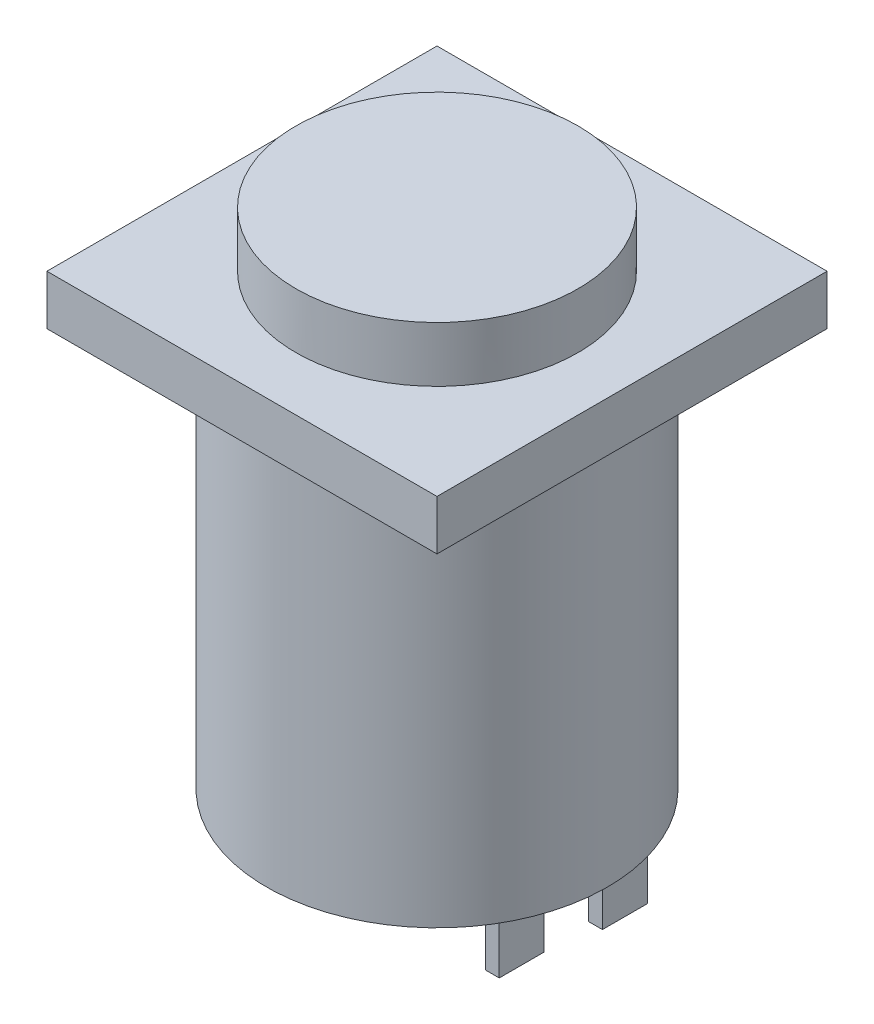
ISO-10303-21;
HEADER;
FILE_DESCRIPTION(('STEP AP214'),'2;1');
FILE_NAME('part.step','',(''),(''),'','','');
FILE_SCHEMA(('AUTOMOTIVE_DESIGN { 1 0 10303 214 1 1 1 1 }'));
ENDSEC;
DATA;
#1=APPLICATION_CONTEXT('core data for automotive mechanical design processes');
#2=APPLICATION_PROTOCOL_DEFINITION('international standard','automotive_design',2000,#1);
#3=PRODUCT_CONTEXT('',#1,'mechanical');
#4=PRODUCT('Part','Part','',(#3));
#5=PRODUCT_RELATED_PRODUCT_CATEGORY('part','',(#4));
#6=PRODUCT_DEFINITION_FORMATION('','',#4);
#7=PRODUCT_DEFINITION_CONTEXT('part definition',#1,'design');
#8=PRODUCT_DEFINITION('design','',#6,#7);
#9=PRODUCT_DEFINITION_SHAPE('','',#8);
#10=(LENGTH_UNIT() NAMED_UNIT(*) SI_UNIT(.MILLI.,.METRE.));
#11=(NAMED_UNIT(*) PLANE_ANGLE_UNIT() SI_UNIT($,.RADIAN.));
#12=(NAMED_UNIT(*) SI_UNIT($,.STERADIAN.) SOLID_ANGLE_UNIT());
#13=UNCERTAINTY_MEASURE_WITH_UNIT(LENGTH_MEASURE(1.E-05),#10,'distance_accuracy_value','');
#14=(GEOMETRIC_REPRESENTATION_CONTEXT(3) GLOBAL_UNCERTAINTY_ASSIGNED_CONTEXT((#13)) GLOBAL_UNIT_ASSIGNED_CONTEXT((#10,
#11,#12)) REPRESENTATION_CONTEXT('',''));
#15=CARTESIAN_POINT('',(0.,0.,0.));
#16=DIRECTION('',(0.,0.,1.));
#17=DIRECTION('',(1.,0.,0.));
#18=AXIS2_PLACEMENT_3D('',#15,#16,#17);
#19=CARTESIAN_POINT('',(0.,-18.288,0.));
#20=DIRECTION('',(0.,-1.,0.));
#21=DIRECTION('',(0.,0.,-1.));
#22=AXIS2_PLACEMENT_3D('',#19,#20,#21);
#23=PLANE('',#22);
#24=DIRECTION('',(1.,0.,0.));
#25=VECTOR('',#24,1.);
#26=CARTESIAN_POINT('',(-3.302,-18.288,-6.35));
#27=LINE('',#26,#25);
#28=CARTESIAN_POINT('',(-3.302,-18.288,-6.35));
#29=VERTEX_POINT('',#28);
#30=CARTESIAN_POINT('',(-2.667,-18.288,-6.35));
#31=VERTEX_POINT('',#30);
#32=EDGE_CURVE('E243',#29,#31,#27,.T.);
#33=ORIENTED_EDGE('',*,*,#32,.F.);
#34=DIRECTION('',(0.,0.,-1.));
#35=VECTOR('',#34,1.);
#36=CARTESIAN_POINT('',(-3.302,-18.288,-4.2926));
#37=LINE('',#36,#35);
#38=CARTESIAN_POINT('',(-3.302,-18.288,-4.2926));
#39=VERTEX_POINT('',#38);
#40=EDGE_CURVE('E238',#39,#29,#37,.T.);
#41=ORIENTED_EDGE('',*,*,#40,.F.);
#42=DIRECTION('',(-1.,0.,0.));
#43=VECTOR('',#42,1.);
#44=CARTESIAN_POINT('',(-3.302,-18.288,-4.2926));
#45=LINE('',#44,#43);
#46=CARTESIAN_POINT('',(-2.667,-18.288,-4.2926));
#47=VERTEX_POINT('',#46);
#48=EDGE_CURVE('E254',#47,#39,#45,.T.);
#49=ORIENTED_EDGE('',*,*,#48,.F.);
#50=DIRECTION('',(0.,0.,1.));
#51=VECTOR('',#50,1.);
#52=CARTESIAN_POINT('',(-2.667,-18.288,-4.2926));
#53=LINE('',#52,#51);
#54=EDGE_CURVE('E266',#31,#47,#53,.T.);
#55=ORIENTED_EDGE('',*,*,#54,.F.);
#56=EDGE_LOOP('',(#33,#41,#49,#55));
#57=FACE_BOUND('',#56,.T.);
#58=DIRECTION('',(1.,0.,0.));
#59=VECTOR('',#58,1.);
#60=CARTESIAN_POINT('',(-2.8575,-18.288,-2.0574));
#61=LINE('',#60,#59);
#62=CARTESIAN_POINT('',(-2.8575,-18.288,-2.0574));
#63=VERTEX_POINT('',#62);
#64=CARTESIAN_POINT('',(-2.2225,-18.288,-2.0574));
#65=VERTEX_POINT('',#64);
#66=EDGE_CURVE('E342',#63,#65,#61,.T.);
#67=ORIENTED_EDGE('',*,*,#66,.F.);
#68=DIRECTION('',(0.,0.,-1.));
#69=VECTOR('',#68,1.);
#70=CARTESIAN_POINT('',(-2.8575,-18.288,0.));
#71=LINE('',#70,#69);
#72=CARTESIAN_POINT('',(-2.8575,-18.288,0.));
#73=VERTEX_POINT('',#72);
#74=EDGE_CURVE('E323',#73,#63,#71,.T.);
#75=ORIENTED_EDGE('',*,*,#74,.F.);
#76=DIRECTION('',(-1.,0.,0.));
#77=VECTOR('',#76,1.);
#78=CARTESIAN_POINT('',(-2.8575,-18.288,0.));
#79=LINE('',#78,#77);
#80=CARTESIAN_POINT('',(-2.2225,-18.288,0.));
#81=VERTEX_POINT('',#80);
#82=EDGE_CURVE('E329',#81,#73,#79,.T.);
#83=ORIENTED_EDGE('',*,*,#82,.F.);
#84=DIRECTION('',(0.,0.,1.));
#85=VECTOR('',#84,1.);
#86=CARTESIAN_POINT('',(-2.2225,-18.288,0.));
#87=LINE('',#86,#85);
#88=EDGE_CURVE('E345',#65,#81,#87,.T.);
#89=ORIENTED_EDGE('',*,*,#88,.F.);
#90=EDGE_LOOP('',(#67,#75,#83,#89));
#91=FACE_BOUND('',#90,.T.);
#92=CARTESIAN_POINT('',(0.,-18.288,0.));
#93=DIRECTION('',(0.,-1.,0.));
#94=DIRECTION('',(0.,0.,-1.));
#95=AXIS2_PLACEMENT_3D('',#92,#93,#94);
#96=CIRCLE('',#95,7.8232);
#97=CARTESIAN_POINT('',(0.,-18.288,-7.8232));
#98=VERTEX_POINT('',#97);
#99=EDGE_CURVE('E365',#98,#98,#96,.T.);
#100=ORIENTED_EDGE('',*,*,#99,.T.);
#101=EDGE_LOOP('',(#100));
#102=FACE_BOUND('',#101,.T.);
#103=DIRECTION('',(1.,0.,0.));
#104=VECTOR('',#103,1.);
#105=CARTESIAN_POINT('',(2.2225,-18.288,-2.0574));
#106=LINE('',#105,#104);
#107=CARTESIAN_POINT('',(2.2225,-18.288,-2.0574));
#108=VERTEX_POINT('',#107);
#109=CARTESIAN_POINT('',(2.8575,-18.288,-2.0574));
#110=VERTEX_POINT('',#109);
#111=EDGE_CURVE('E302',#108,#110,#106,.T.);
#112=ORIENTED_EDGE('',*,*,#111,.F.);
#113=DIRECTION('',(0.,0.,-1.));
#114=VECTOR('',#113,1.);
#115=CARTESIAN_POINT('',(2.2225,-18.288,0.));
#116=LINE('',#115,#114);
#117=CARTESIAN_POINT('',(2.2225,-18.288,0.));
#118=VERTEX_POINT('',#117);
#119=EDGE_CURVE('E283',#118,#108,#116,.T.);
#120=ORIENTED_EDGE('',*,*,#119,.F.);
#121=DIRECTION('',(-1.,0.,0.));
#122=VECTOR('',#121,1.);
#123=CARTESIAN_POINT('',(2.2225,-18.288,0.));
#124=LINE('',#123,#122);
#125=CARTESIAN_POINT('',(2.8575,-18.288,0.));
#126=VERTEX_POINT('',#125);
#127=EDGE_CURVE('E289',#126,#118,#124,.T.);
#128=ORIENTED_EDGE('',*,*,#127,.F.);
#129=DIRECTION('',(0.,0.,1.));
#130=VECTOR('',#129,1.);
#131=CARTESIAN_POINT('',(2.8575,-18.288,0.));
#132=LINE('',#131,#130);
#133=EDGE_CURVE('E305',#110,#126,#132,.T.);
#134=ORIENTED_EDGE('',*,*,#133,.F.);
#135=EDGE_LOOP('',(#112,#120,#128,#134));
#136=FACE_BOUND('',#135,.T.);
#137=DIRECTION('',(-1.,0.,0.));
#138=VECTOR('',#137,1.);
#139=CARTESIAN_POINT('',(3.302,-18.288,-4.2926));
#140=LINE('',#139,#138);
#141=CARTESIAN_POINT('',(3.302,-18.288,-4.2926));
#142=VERTEX_POINT('',#141);
#143=CARTESIAN_POINT('',(2.667,-18.288,-4.2926));
#144=VERTEX_POINT('',#143);
#145=EDGE_CURVE('E478',#142,#144,#140,.T.);
#146=ORIENTED_EDGE('',*,*,#145,.F.);
#147=DIRECTION('',(0.,0.,1.));
#148=VECTOR('',#147,1.);
#149=CARTESIAN_POINT('',(3.302,-18.288,-4.2926));
#150=LINE('',#149,#148);
#151=CARTESIAN_POINT('',(3.302,-18.288,-6.35));
#152=VERTEX_POINT('',#151);
#153=EDGE_CURVE('E235',#152,#142,#150,.T.);
#154=ORIENTED_EDGE('',*,*,#153,.F.);
#155=DIRECTION('',(1.,0.,0.));
#156=VECTOR('',#155,1.);
#157=CARTESIAN_POINT('',(3.302,-18.288,-6.35));
#158=LINE('',#157,#156);
#159=CARTESIAN_POINT('',(2.667,-18.288,-6.35));
#160=VERTEX_POINT('',#159);
#161=EDGE_CURVE('E231',#160,#152,#158,.T.);
#162=ORIENTED_EDGE('',*,*,#161,.F.);
#163=DIRECTION('',(0.,0.,-1.));
#164=VECTOR('',#163,1.);
#165=CARTESIAN_POINT('',(2.667,-18.288,-4.2926));
#166=LINE('',#165,#164);
#167=EDGE_CURVE('E480',#144,#160,#166,.T.);
#168=ORIENTED_EDGE('',*,*,#167,.F.);
#169=EDGE_LOOP('',(#146,#154,#162,#168));
#170=FACE_BOUND('',#169,.T.);
#171=ADVANCED_FACE('F38',(#57,#91,#102,#136,#170),#23,.T.);
#172=CARTESIAN_POINT('',(0.,0.,0.));
#173=DIRECTION('',(0.,-1.,0.));
#174=DIRECTION('',(0.,0.,-1.));
#175=AXIS2_PLACEMENT_3D('',#172,#173,#174);
#176=PLANE('',#175);
#177=DIRECTION('',(0.,0.,-1.));
#178=VECTOR('',#177,1.);
#179=CARTESIAN_POINT('',(8.9535,0.,-8.9535));
#180=LINE('',#179,#178);
#181=CARTESIAN_POINT('',(8.9535,0.,8.9535));
#182=VERTEX_POINT('',#181);
#183=CARTESIAN_POINT('',(8.9535,0.,-8.9535));
#184=VERTEX_POINT('',#183);
#185=EDGE_CURVE('E375',#182,#184,#180,.T.);
#186=ORIENTED_EDGE('',*,*,#185,.F.);
#187=DIRECTION('',(1.,0.,0.));
#188=VECTOR('',#187,1.);
#189=CARTESIAN_POINT('',(8.9535,0.,8.9535));
#190=LINE('',#189,#188);
#191=CARTESIAN_POINT('',(-8.9535,0.,8.9535));
#192=VERTEX_POINT('',#191);
#193=EDGE_CURVE('E381',#192,#182,#190,.T.);
#194=ORIENTED_EDGE('',*,*,#193,.F.);
#195=DIRECTION('',(0.,0.,1.));
#196=VECTOR('',#195,1.);
#197=CARTESIAN_POINT('',(-8.9535,0.,-8.9535));
#198=LINE('',#197,#196);
#199=CARTESIAN_POINT('',(-8.9535,0.,-8.9535));
#200=VERTEX_POINT('',#199);
#201=EDGE_CURVE('E395',#200,#192,#198,.T.);
#202=ORIENTED_EDGE('',*,*,#201,.F.);
#203=DIRECTION('',(-1.,0.,0.));
#204=VECTOR('',#203,1.);
#205=CARTESIAN_POINT('',(8.9535,0.,-8.9535));
#206=LINE('',#205,#204);
#207=EDGE_CURVE('E392',#184,#200,#206,.T.);
#208=ORIENTED_EDGE('',*,*,#207,.F.);
#209=EDGE_LOOP('',(#186,#194,#202,#208));
#210=FACE_BOUND('',#209,.T.);
#211=CARTESIAN_POINT('',(0.,0.,0.));
#212=DIRECTION('',(0.,-1.,0.));
#213=DIRECTION('',(0.,0.,-1.));
#214=AXIS2_PLACEMENT_3D('',#211,#212,#213);
#215=CIRCLE('',#214,7.8232);
#216=CARTESIAN_POINT('',(0.,0.,-7.8232));
#217=VERTEX_POINT('',#216);
#218=EDGE_CURVE('E364',#217,#217,#215,.T.);
#219=ORIENTED_EDGE('',*,*,#218,.F.);
#220=EDGE_LOOP('',(#219));
#221=FACE_BOUND('',#220,.T.);
#222=ADVANCED_FACE('F417',(#210,#221),#176,.T.);
#223=CARTESIAN_POINT('',(0.,2.286,0.));
#224=DIRECTION('',(0.,-1.,0.));
#225=DIRECTION('',(0.,0.,-1.));
#226=AXIS2_PLACEMENT_3D('',#223,#224,#225);
#227=PLANE('',#226);
#228=DIRECTION('',(0.,0.,-1.));
#229=VECTOR('',#228,1.);
#230=CARTESIAN_POINT('',(8.9535,2.286,-8.9535));
#231=LINE('',#230,#229);
#232=CARTESIAN_POINT('',(8.9535,2.286,8.9535));
#233=VERTEX_POINT('',#232);
#234=CARTESIAN_POINT('',(8.9535,2.286,-8.9535));
#235=VERTEX_POINT('',#234);
#236=EDGE_CURVE('E376',#233,#235,#231,.T.);
#237=ORIENTED_EDGE('',*,*,#236,.T.);
#238=DIRECTION('',(-1.,0.,0.));
#239=VECTOR('',#238,1.);
#240=CARTESIAN_POINT('',(8.9535,2.286,-8.9535));
#241=LINE('',#240,#239);
#242=CARTESIAN_POINT('',(-8.9535,2.286,-8.9535));
#243=VERTEX_POINT('',#242);
#244=EDGE_CURVE('E380',#235,#243,#241,.T.);
#245=ORIENTED_EDGE('',*,*,#244,.T.);
#246=DIRECTION('',(0.,0.,1.));
#247=VECTOR('',#246,1.);
#248=CARTESIAN_POINT('',(-8.9535,2.286,-8.9535));
#249=LINE('',#248,#247);
#250=CARTESIAN_POINT('',(-8.9535,2.286,8.9535));
#251=VERTEX_POINT('',#250);
#252=EDGE_CURVE('E384',#243,#251,#249,.T.);
#253=ORIENTED_EDGE('',*,*,#252,.T.);
#254=DIRECTION('',(1.,0.,0.));
#255=VECTOR('',#254,1.);
#256=CARTESIAN_POINT('',(8.9535,2.286,8.9535));
#257=LINE('',#256,#255);
#258=EDGE_CURVE('E386',#251,#233,#257,.T.);
#259=ORIENTED_EDGE('',*,*,#258,.T.);
#260=EDGE_LOOP('',(#237,#245,#253,#259));
#261=FACE_BOUND('',#260,.T.);
#262=CARTESIAN_POINT('',(0.,2.286,0.));
#263=DIRECTION('',(0.,-1.,0.));
#264=DIRECTION('',(0.,0.,-1.));
#265=AXIS2_PLACEMENT_3D('',#262,#263,#264);
#266=CIRCLE('',#265,6.477);
#267=CARTESIAN_POINT('',(0.,2.286,-6.477));
#268=VERTEX_POINT('',#267);
#269=EDGE_CURVE('E11',#268,#268,#266,.F.);
#270=ORIENTED_EDGE('',*,*,#269,.F.);
#271=EDGE_LOOP('',(#270));
#272=FACE_BOUND('',#271,.T.);
#273=ADVANCED_FACE('F428',(#261,#272),#227,.F.);
#274=CARTESIAN_POINT('',(8.9535,2.286,-8.9535));
#275=DIRECTION('',(-1.,0.,0.));
#276=DIRECTION('',(0.,0.,1.));
#277=AXIS2_PLACEMENT_3D('',#274,#275,#276);
#278=PLANE('',#277);
#279=ORIENTED_EDGE('',*,*,#185,.T.);
#280=DIRECTION('',(0.,-1.,0.));
#281=VECTOR('',#280,1.);
#282=CARTESIAN_POINT('',(8.9535,2.286,-8.9535));
#283=LINE('',#282,#281);
#284=EDGE_CURVE('E46',#235,#184,#283,.T.);
#285=ORIENTED_EDGE('',*,*,#284,.F.);
#286=ORIENTED_EDGE('',*,*,#236,.F.);
#287=DIRECTION('',(0.,-1.,0.));
#288=VECTOR('',#287,1.);
#289=CARTESIAN_POINT('',(8.9535,2.286,8.9535));
#290=LINE('',#289,#288);
#291=EDGE_CURVE('E388',#233,#182,#290,.T.);
#292=ORIENTED_EDGE('',*,*,#291,.T.);
#293=EDGE_LOOP('',(#279,#285,#286,#292));
#294=FACE_BOUND('',#293,.T.);
#295=ADVANCED_FACE('F40',(#294),#278,.F.);
#296=CARTESIAN_POINT('',(8.9535,2.286,-8.9535));
#297=DIRECTION('',(0.,0.,1.));
#298=DIRECTION('',(1.,0.,0.));
#299=AXIS2_PLACEMENT_3D('',#296,#297,#298);
#300=PLANE('',#299);
#301=ORIENTED_EDGE('',*,*,#207,.T.);
#302=DIRECTION('',(0.,-1.,0.));
#303=VECTOR('',#302,1.);
#304=CARTESIAN_POINT('',(-8.9535,2.286,-8.9535));
#305=LINE('',#304,#303);
#306=EDGE_CURVE('E403',#243,#200,#305,.T.);
#307=ORIENTED_EDGE('',*,*,#306,.F.);
#308=ORIENTED_EDGE('',*,*,#244,.F.);
#309=ORIENTED_EDGE('',*,*,#284,.T.);
#310=EDGE_LOOP('',(#301,#307,#308,#309));
#311=FACE_BOUND('',#310,.T.);
#312=ADVANCED_FACE('F409',(#311),#300,.F.);
#313=CARTESIAN_POINT('',(-8.9535,2.286,-8.9535));
#314=DIRECTION('',(1.,0.,0.));
#315=DIRECTION('',(0.,0.,-1.));
#316=AXIS2_PLACEMENT_3D('',#313,#314,#315);
#317=PLANE('',#316);
#318=ORIENTED_EDGE('',*,*,#201,.T.);
#319=DIRECTION('',(0.,-1.,0.));
#320=VECTOR('',#319,1.);
#321=CARTESIAN_POINT('',(-8.9535,2.286,8.9535));
#322=LINE('',#321,#320);
#323=EDGE_CURVE('E400',#251,#192,#322,.T.);
#324=ORIENTED_EDGE('',*,*,#323,.F.);
#325=ORIENTED_EDGE('',*,*,#252,.F.);
#326=ORIENTED_EDGE('',*,*,#306,.T.);
#327=EDGE_LOOP('',(#318,#324,#325,#326));
#328=FACE_BOUND('',#327,.T.);
#329=ADVANCED_FACE('F422',(#328),#317,.F.);
#330=CARTESIAN_POINT('',(8.9535,2.286,8.9535));
#331=DIRECTION('',(0.,0.,-1.));
#332=DIRECTION('',(-1.,0.,0.));
#333=AXIS2_PLACEMENT_3D('',#330,#331,#332);
#334=PLANE('',#333);
#335=ORIENTED_EDGE('',*,*,#193,.T.);
#336=ORIENTED_EDGE('',*,*,#291,.F.);
#337=ORIENTED_EDGE('',*,*,#258,.F.);
#338=ORIENTED_EDGE('',*,*,#323,.T.);
#339=EDGE_LOOP('',(#335,#336,#337,#338));
#340=FACE_BOUND('',#339,.T.);
#341=ADVANCED_FACE('F426',(#340),#334,.F.);
#342=CARTESIAN_POINT('',(0.,4.826,0.));
#343=DIRECTION('',(0.,-1.,0.));
#344=DIRECTION('',(0.,0.,-1.));
#345=AXIS2_PLACEMENT_3D('',#342,#343,#344);
#346=CYLINDRICAL_SURFACE('',#345,6.477);
#347=CARTESIAN_POINT('',(0.,4.826,0.));
#348=DIRECTION('',(0.,1.,0.));
#349=DIRECTION('',(0.,0.,1.));
#350=AXIS2_PLACEMENT_3D('',#347,#348,#349);
#351=CIRCLE('',#350,6.477);
#352=CARTESIAN_POINT('',(0.,4.826,6.477));
#353=VERTEX_POINT('',#352);
#354=EDGE_CURVE('E369',#353,#353,#351,.T.);
#355=ORIENTED_EDGE('',*,*,#354,.F.);
#356=EDGE_LOOP('',(#355));
#357=FACE_BOUND('',#356,.T.);
#358=ORIENTED_EDGE('',*,*,#269,.T.);
#359=EDGE_LOOP('',(#358));
#360=FACE_BOUND('',#359,.T.);
#361=ADVANCED_FACE('F434',(#357,#360),#346,.T.);
#362=CARTESIAN_POINT('',(0.,4.826,0.));
#363=DIRECTION('',(0.,1.,0.));
#364=DIRECTION('',(0.,0.,1.));
#365=AXIS2_PLACEMENT_3D('',#362,#363,#364);
#366=PLANE('',#365);
#367=ORIENTED_EDGE('',*,*,#354,.T.);
#368=EDGE_LOOP('',(#367));
#369=FACE_BOUND('',#368,.T.);
#370=ADVANCED_FACE('F436',(#369),#366,.T.);
#371=CARTESIAN_POINT('',(0.,-18.288,0.));
#372=DIRECTION('',(0.,1.,0.));
#373=DIRECTION('',(0.,0.,1.));
#374=AXIS2_PLACEMENT_3D('',#371,#372,#373);
#375=CYLINDRICAL_SURFACE('',#374,7.8232);
#376=ORIENTED_EDGE('',*,*,#99,.F.);
#377=EDGE_LOOP('',(#376));
#378=FACE_BOUND('',#377,.T.);
#379=ORIENTED_EDGE('',*,*,#218,.T.);
#380=EDGE_LOOP('',(#379));
#381=FACE_BOUND('',#380,.T.);
#382=ADVANCED_FACE('F443',(#378,#381),#375,.T.);
#383=CARTESIAN_POINT('',(-2.8575,-24.384,0.));
#384=DIRECTION('',(1.,0.,0.));
#385=DIRECTION('',(0.,0.,-1.));
#386=AXIS2_PLACEMENT_3D('',#383,#384,#385);
#387=PLANE('',#386);
#388=ORIENTED_EDGE('',*,*,#74,.T.);
#389=DIRECTION('',(0.,1.,0.));
#390=VECTOR('',#389,1.);
#391=CARTESIAN_POINT('',(-2.8575,-24.384,-2.0574));
#392=LINE('',#391,#390);
#393=CARTESIAN_POINT('',(-2.8575,-24.384,-2.0574));
#394=VERTEX_POINT('',#393);
#395=EDGE_CURVE('E361',#394,#63,#392,.T.);
#396=ORIENTED_EDGE('',*,*,#395,.F.);
#397=DIRECTION('',(0.,0.,-1.));
#398=VECTOR('',#397,1.);
#399=CARTESIAN_POINT('',(-2.8575,-24.384,0.));
#400=LINE('',#399,#398);
#401=CARTESIAN_POINT('',(-2.8575,-24.384,0.));
#402=VERTEX_POINT('',#401);
#403=EDGE_CURVE('E324',#402,#394,#400,.T.);
#404=ORIENTED_EDGE('',*,*,#403,.F.);
#405=DIRECTION('',(0.,1.,0.));
#406=VECTOR('',#405,1.);
#407=CARTESIAN_POINT('',(-2.8575,-24.384,0.));
#408=LINE('',#407,#406);
#409=EDGE_CURVE('E338',#402,#73,#408,.T.);
#410=ORIENTED_EDGE('',*,*,#409,.T.);
#411=EDGE_LOOP('',(#388,#396,#404,#410));
#412=FACE_BOUND('',#411,.T.);
#413=ADVANCED_FACE('F459',(#412),#387,.F.);
#414=CARTESIAN_POINT('',(-2.8575,-24.384,-2.0574));
#415=DIRECTION('',(0.,0.,1.));
#416=DIRECTION('',(1.,0.,0.));
#417=AXIS2_PLACEMENT_3D('',#414,#415,#416);
#418=PLANE('',#417);
#419=ORIENTED_EDGE('',*,*,#66,.T.);
#420=DIRECTION('',(0.,1.,0.));
#421=VECTOR('',#420,1.);
#422=CARTESIAN_POINT('',(-2.2225,-24.384,-2.0574));
#423=LINE('',#422,#421);
#424=CARTESIAN_POINT('',(-2.2225,-24.384,-2.0574));
#425=VERTEX_POINT('',#424);
#426=EDGE_CURVE('E357',#425,#65,#423,.T.);
#427=ORIENTED_EDGE('',*,*,#426,.F.);
#428=DIRECTION('',(1.,0.,0.));
#429=VECTOR('',#428,1.);
#430=CARTESIAN_POINT('',(-2.8575,-24.384,-2.0574));
#431=LINE('',#430,#429);
#432=EDGE_CURVE('E328',#394,#425,#431,.T.);
#433=ORIENTED_EDGE('',*,*,#432,.F.);
#434=ORIENTED_EDGE('',*,*,#395,.T.);
#435=EDGE_LOOP('',(#419,#427,#433,#434));
#436=FACE_BOUND('',#435,.T.);
#437=ADVANCED_FACE('F466',(#436),#418,.F.);
#438=CARTESIAN_POINT('',(-2.2225,-24.384,0.));
#439=DIRECTION('',(-1.,0.,0.));
#440=DIRECTION('',(0.,0.,1.));
#441=AXIS2_PLACEMENT_3D('',#438,#439,#440);
#442=PLANE('',#441);
#443=ORIENTED_EDGE('',*,*,#88,.T.);
#444=DIRECTION('',(0.,1.,0.));
#445=VECTOR('',#444,1.);
#446=CARTESIAN_POINT('',(-2.2225,-24.384,0.));
#447=LINE('',#446,#445);
#448=CARTESIAN_POINT('',(-2.2225,-24.384,0.));
#449=VERTEX_POINT('',#448);
#450=EDGE_CURVE('E354',#449,#81,#447,.T.);
#451=ORIENTED_EDGE('',*,*,#450,.F.);
#452=DIRECTION('',(0.,0.,1.));
#453=VECTOR('',#452,1.);
#454=CARTESIAN_POINT('',(-2.2225,-24.384,0.));
#455=LINE('',#454,#453);
#456=EDGE_CURVE('E332',#425,#449,#455,.T.);
#457=ORIENTED_EDGE('',*,*,#456,.F.);
#458=ORIENTED_EDGE('',*,*,#426,.T.);
#459=EDGE_LOOP('',(#443,#451,#457,#458));
#460=FACE_BOUND('',#459,.T.);
#461=ADVANCED_FACE('F559',(#460),#442,.F.);
#462=CARTESIAN_POINT('',(-2.8575,-24.384,0.));
#463=DIRECTION('',(0.,0.,-1.));
#464=DIRECTION('',(-1.,0.,0.));
#465=AXIS2_PLACEMENT_3D('',#462,#463,#464);
#466=PLANE('',#465);
#467=ORIENTED_EDGE('',*,*,#82,.T.);
#468=ORIENTED_EDGE('',*,*,#409,.F.);
#469=DIRECTION('',(-1.,0.,0.));
#470=VECTOR('',#469,1.);
#471=CARTESIAN_POINT('',(-2.8575,-24.384,0.));
#472=LINE('',#471,#470);
#473=EDGE_CURVE('E335',#449,#402,#472,.T.);
#474=ORIENTED_EDGE('',*,*,#473,.F.);
#475=ORIENTED_EDGE('',*,*,#450,.T.);
#476=EDGE_LOOP('',(#467,#468,#474,#475));
#477=FACE_BOUND('',#476,.T.);
#478=ADVANCED_FACE('F555',(#477),#466,.F.);
#479=CARTESIAN_POINT('',(0.,-24.384,0.));
#480=DIRECTION('',(0.,-1.,0.));
#481=DIRECTION('',(0.,0.,-1.));
#482=AXIS2_PLACEMENT_3D('',#479,#480,#481);
#483=PLANE('',#482);
#484=ORIENTED_EDGE('',*,*,#403,.T.);
#485=ORIENTED_EDGE('',*,*,#432,.T.);
#486=ORIENTED_EDGE('',*,*,#456,.T.);
#487=ORIENTED_EDGE('',*,*,#473,.T.);
#488=EDGE_LOOP('',(#484,#485,#486,#487));
#489=FACE_BOUND('',#488,.T.);
#490=ADVANCED_FACE('F551',(#489),#483,.T.);
#491=CARTESIAN_POINT('',(2.2225,-24.384,0.));
#492=DIRECTION('',(1.,0.,0.));
#493=DIRECTION('',(0.,0.,-1.));
#494=AXIS2_PLACEMENT_3D('',#491,#492,#493);
#495=PLANE('',#494);
#496=ORIENTED_EDGE('',*,*,#119,.T.);
#497=DIRECTION('',(0.,1.,0.));
#498=VECTOR('',#497,1.);
#499=CARTESIAN_POINT('',(2.2225,-24.384,-2.0574));
#500=LINE('',#499,#498);
#501=CARTESIAN_POINT('',(2.2225,-24.384,-2.0574));
#502=VERTEX_POINT('',#501);
#503=EDGE_CURVE('E320',#502,#108,#500,.T.);
#504=ORIENTED_EDGE('',*,*,#503,.F.);
#505=DIRECTION('',(0.,0.,-1.));
#506=VECTOR('',#505,1.);
#507=CARTESIAN_POINT('',(2.2225,-24.384,0.));
#508=LINE('',#507,#506);
#509=CARTESIAN_POINT('',(2.2225,-24.384,0.));
#510=VERTEX_POINT('',#509);
#511=EDGE_CURVE('E284',#510,#502,#508,.T.);
#512=ORIENTED_EDGE('',*,*,#511,.F.);
#513=DIRECTION('',(0.,1.,0.));
#514=VECTOR('',#513,1.);
#515=CARTESIAN_POINT('',(2.2225,-24.384,0.));
#516=LINE('',#515,#514);
#517=EDGE_CURVE('E298',#510,#118,#516,.T.);
#518=ORIENTED_EDGE('',*,*,#517,.T.);
#519=EDGE_LOOP('',(#496,#504,#512,#518));
#520=FACE_BOUND('',#519,.T.);
#521=ADVANCED_FACE('F547',(#520),#495,.F.);
#522=CARTESIAN_POINT('',(2.2225,-24.384,-2.0574));
#523=DIRECTION('',(0.,0.,1.));
#524=DIRECTION('',(1.,0.,0.));
#525=AXIS2_PLACEMENT_3D('',#522,#523,#524);
#526=PLANE('',#525);
#527=ORIENTED_EDGE('',*,*,#111,.T.);
#528=DIRECTION('',(0.,1.,0.));
#529=VECTOR('',#528,1.);
#530=CARTESIAN_POINT('',(2.8575,-24.384,-2.0574));
#531=LINE('',#530,#529);
#532=CARTESIAN_POINT('',(2.8575,-24.384,-2.0574));
#533=VERTEX_POINT('',#532);
#534=EDGE_CURVE('E316',#533,#110,#531,.T.);
#535=ORIENTED_EDGE('',*,*,#534,.F.);
#536=DIRECTION('',(1.,0.,0.));
#537=VECTOR('',#536,1.);
#538=CARTESIAN_POINT('',(2.2225,-24.384,-2.0574));
#539=LINE('',#538,#537);
#540=EDGE_CURVE('E288',#502,#533,#539,.T.);
#541=ORIENTED_EDGE('',*,*,#540,.F.);
#542=ORIENTED_EDGE('',*,*,#503,.T.);
#543=EDGE_LOOP('',(#527,#535,#541,#542));
#544=FACE_BOUND('',#543,.T.);
#545=ADVANCED_FACE('F543',(#544),#526,.F.);
#546=CARTESIAN_POINT('',(2.8575,-24.384,0.));
#547=DIRECTION('',(-1.,0.,0.));
#548=DIRECTION('',(0.,0.,1.));
#549=AXIS2_PLACEMENT_3D('',#546,#547,#548);
#550=PLANE('',#549);
#551=ORIENTED_EDGE('',*,*,#133,.T.);
#552=DIRECTION('',(0.,1.,0.));
#553=VECTOR('',#552,1.);
#554=CARTESIAN_POINT('',(2.8575,-24.384,0.));
#555=LINE('',#554,#553);
#556=CARTESIAN_POINT('',(2.8575,-24.384,0.));
#557=VERTEX_POINT('',#556);
#558=EDGE_CURVE('E313',#557,#126,#555,.T.);
#559=ORIENTED_EDGE('',*,*,#558,.F.);
#560=DIRECTION('',(0.,0.,1.));
#561=VECTOR('',#560,1.);
#562=CARTESIAN_POINT('',(2.8575,-24.384,0.));
#563=LINE('',#562,#561);
#564=EDGE_CURVE('E292',#533,#557,#563,.T.);
#565=ORIENTED_EDGE('',*,*,#564,.F.);
#566=ORIENTED_EDGE('',*,*,#534,.T.);
#567=EDGE_LOOP('',(#551,#559,#565,#566));
#568=FACE_BOUND('',#567,.T.);
#569=ADVANCED_FACE('F539',(#568),#550,.F.);
#570=CARTESIAN_POINT('',(2.2225,-24.384,0.));
#571=DIRECTION('',(0.,0.,-1.));
#572=DIRECTION('',(-1.,0.,0.));
#573=AXIS2_PLACEMENT_3D('',#570,#571,#572);
#574=PLANE('',#573);
#575=ORIENTED_EDGE('',*,*,#127,.T.);
#576=ORIENTED_EDGE('',*,*,#517,.F.);
#577=DIRECTION('',(-1.,0.,0.));
#578=VECTOR('',#577,1.);
#579=CARTESIAN_POINT('',(2.2225,-24.384,0.));
#580=LINE('',#579,#578);
#581=EDGE_CURVE('E295',#557,#510,#580,.T.);
#582=ORIENTED_EDGE('',*,*,#581,.F.);
#583=ORIENTED_EDGE('',*,*,#558,.T.);
#584=EDGE_LOOP('',(#575,#576,#582,#583));
#585=FACE_BOUND('',#584,.T.);
#586=ADVANCED_FACE('F535',(#585),#574,.F.);
#587=CARTESIAN_POINT('',(0.,-24.384,0.));
#588=DIRECTION('',(0.,-1.,0.));
#589=DIRECTION('',(0.,0.,-1.));
#590=AXIS2_PLACEMENT_3D('',#587,#588,#589);
#591=PLANE('',#590);
#592=ORIENTED_EDGE('',*,*,#511,.T.);
#593=ORIENTED_EDGE('',*,*,#540,.T.);
#594=ORIENTED_EDGE('',*,*,#564,.T.);
#595=ORIENTED_EDGE('',*,*,#581,.T.);
#596=EDGE_LOOP('',(#592,#593,#594,#595));
#597=FACE_BOUND('',#596,.T.);
#598=ADVANCED_FACE('F531',(#597),#591,.T.);
#599=CARTESIAN_POINT('',(-3.302,-24.384,-4.2926));
#600=DIRECTION('',(1.,0.,0.));
#601=DIRECTION('',(0.,0.,-1.));
#602=AXIS2_PLACEMENT_3D('',#599,#600,#601);
#603=PLANE('',#602);
#604=ORIENTED_EDGE('',*,*,#40,.T.);
#605=DIRECTION('',(0.,1.,0.));
#606=VECTOR('',#605,1.);
#607=CARTESIAN_POINT('',(-3.302,-24.384,-6.35));
#608=LINE('',#607,#606);
#609=CARTESIAN_POINT('',(-3.302,-24.384,-6.35));
#610=VERTEX_POINT('',#609);
#611=EDGE_CURVE('E280',#610,#29,#608,.T.);
#612=ORIENTED_EDGE('',*,*,#611,.F.);
#613=DIRECTION('',(0.,0.,-1.));
#614=VECTOR('',#613,1.);
#615=CARTESIAN_POINT('',(-3.302,-24.384,-4.2926));
#616=LINE('',#615,#614);
#617=CARTESIAN_POINT('',(-3.302,-24.384,-4.2926));
#618=VERTEX_POINT('',#617);
#619=EDGE_CURVE('E249',#618,#610,#616,.T.);
#620=ORIENTED_EDGE('',*,*,#619,.F.);
#621=DIRECTION('',(0.,1.,0.));
#622=VECTOR('',#621,1.);
#623=CARTESIAN_POINT('',(-3.302,-24.384,-4.2926));
#624=LINE('',#623,#622);
#625=EDGE_CURVE('E262',#618,#39,#624,.T.);
#626=ORIENTED_EDGE('',*,*,#625,.T.);
#627=EDGE_LOOP('',(#604,#612,#620,#626));
#628=FACE_BOUND('',#627,.T.);
#629=ADVANCED_FACE('F527',(#628),#603,.F.);
#630=CARTESIAN_POINT('',(-3.302,-24.384,-6.35));
#631=DIRECTION('',(0.,0.,1.));
#632=DIRECTION('',(1.,0.,0.));
#633=AXIS2_PLACEMENT_3D('',#630,#631,#632);
#634=PLANE('',#633);
#635=ORIENTED_EDGE('',*,*,#32,.T.);
#636=DIRECTION('',(0.,1.,0.));
#637=VECTOR('',#636,1.);
#638=CARTESIAN_POINT('',(-2.667,-24.384,-6.35));
#639=LINE('',#638,#637);
#640=CARTESIAN_POINT('',(-2.667,-24.384,-6.35));
#641=VERTEX_POINT('',#640);
#642=EDGE_CURVE('E276',#641,#31,#639,.T.);
#643=ORIENTED_EDGE('',*,*,#642,.F.);
#644=DIRECTION('',(1.,0.,0.));
#645=VECTOR('',#644,1.);
#646=CARTESIAN_POINT('',(-3.302,-24.384,-6.35));
#647=LINE('',#646,#645);
#648=EDGE_CURVE('E253',#610,#641,#647,.T.);
#649=ORIENTED_EDGE('',*,*,#648,.F.);
#650=ORIENTED_EDGE('',*,*,#611,.T.);
#651=EDGE_LOOP('',(#635,#643,#649,#650));
#652=FACE_BOUND('',#651,.T.);
#653=ADVANCED_FACE('F523',(#652),#634,.F.);
#654=CARTESIAN_POINT('',(-2.667,-24.384,-4.2926));
#655=DIRECTION('',(-1.,0.,0.));
#656=DIRECTION('',(0.,0.,1.));
#657=AXIS2_PLACEMENT_3D('',#654,#655,#656);
#658=PLANE('',#657);
#659=ORIENTED_EDGE('',*,*,#54,.T.);
#660=DIRECTION('',(0.,1.,0.));
#661=VECTOR('',#660,1.);
#662=CARTESIAN_POINT('',(-2.667,-24.384,-4.2926));
#663=LINE('',#662,#661);
#664=CARTESIAN_POINT('',(-2.667,-24.384,-4.2926));
#665=VERTEX_POINT('',#664);
#666=EDGE_CURVE('E67',#665,#47,#663,.T.);
#667=ORIENTED_EDGE('',*,*,#666,.F.);
#668=DIRECTION('',(0.,0.,1.));
#669=VECTOR('',#668,1.);
#670=CARTESIAN_POINT('',(-2.667,-24.384,-4.2926));
#671=LINE('',#670,#669);
#672=EDGE_CURVE('E257',#641,#665,#671,.T.);
#673=ORIENTED_EDGE('',*,*,#672,.F.);
#674=ORIENTED_EDGE('',*,*,#642,.T.);
#675=EDGE_LOOP('',(#659,#667,#673,#674));
#676=FACE_BOUND('',#675,.T.);
#677=ADVANCED_FACE('F520',(#676),#658,.F.);
#678=CARTESIAN_POINT('',(-3.302,-24.384,-4.2926));
#679=DIRECTION('',(0.,0.,-1.));
#680=DIRECTION('',(-1.,0.,0.));
#681=AXIS2_PLACEMENT_3D('',#678,#679,#680);
#682=PLANE('',#681);
#683=ORIENTED_EDGE('',*,*,#48,.T.);
#684=ORIENTED_EDGE('',*,*,#625,.F.);
#685=DIRECTION('',(-1.,0.,0.));
#686=VECTOR('',#685,1.);
#687=CARTESIAN_POINT('',(-3.302,-24.384,-4.2926));
#688=LINE('',#687,#686);
#689=EDGE_CURVE('E260',#665,#618,#688,.T.);
#690=ORIENTED_EDGE('',*,*,#689,.F.);
#691=ORIENTED_EDGE('',*,*,#666,.T.);
#692=EDGE_LOOP('',(#683,#684,#690,#691));
#693=FACE_BOUND('',#692,.T.);
#694=ADVANCED_FACE('F516',(#693),#682,.F.);
#695=CARTESIAN_POINT('',(0.,-24.384,0.));
#696=DIRECTION('',(0.,-1.,0.));
#697=DIRECTION('',(0.,0.,-1.));
#698=AXIS2_PLACEMENT_3D('',#695,#696,#697);
#699=PLANE('',#698);
#700=ORIENTED_EDGE('',*,*,#619,.T.);
#701=ORIENTED_EDGE('',*,*,#648,.T.);
#702=ORIENTED_EDGE('',*,*,#672,.T.);
#703=ORIENTED_EDGE('',*,*,#689,.T.);
#704=EDGE_LOOP('',(#700,#701,#702,#703));
#705=FACE_BOUND('',#704,.T.);
#706=ADVANCED_FACE('F513',(#705),#699,.T.);
#707=CARTESIAN_POINT('',(3.302,-24.384,-4.2926));
#708=DIRECTION('',(-1.,0.,0.));
#709=DIRECTION('',(0.,0.,1.));
#710=AXIS2_PLACEMENT_3D('',#707,#708,#709);
#711=PLANE('',#710);
#712=ORIENTED_EDGE('',*,*,#153,.T.);
#713=DIRECTION('',(0.,1.,0.));
#714=VECTOR('',#713,1.);
#715=CARTESIAN_POINT('',(3.302,-24.384,-4.2926));
#716=LINE('',#715,#714);
#717=CARTESIAN_POINT('',(3.302,-24.384,-4.2926));
#718=VERTEX_POINT('',#717);
#719=EDGE_CURVE('E214',#718,#142,#716,.T.);
#720=ORIENTED_EDGE('',*,*,#719,.F.);
#721=DIRECTION('',(0.,0.,1.));
#722=VECTOR('',#721,1.);
#723=CARTESIAN_POINT('',(3.302,-24.384,-4.2926));
#724=LINE('',#723,#722);
#725=CARTESIAN_POINT('',(3.302,-24.384,-6.35));
#726=VERTEX_POINT('',#725);
#727=EDGE_CURVE('E222',#726,#718,#724,.T.);
#728=ORIENTED_EDGE('',*,*,#727,.F.);
#729=DIRECTION('',(0.,1.,0.));
#730=VECTOR('',#729,1.);
#731=CARTESIAN_POINT('',(3.302,-24.384,-6.35));
#732=LINE('',#731,#730);
#733=EDGE_CURVE('E491',#726,#152,#732,.T.);
#734=ORIENTED_EDGE('',*,*,#733,.T.);
#735=EDGE_LOOP('',(#712,#720,#728,#734));
#736=FACE_BOUND('',#735,.T.);
#737=ADVANCED_FACE('F233',(#736),#711,.F.);
#738=CARTESIAN_POINT('',(3.302,-24.384,-4.2926));
#739=DIRECTION('',(0.,0.,-1.));
#740=DIRECTION('',(-1.,0.,0.));
#741=AXIS2_PLACEMENT_3D('',#738,#739,#740);
#742=PLANE('',#741);
#743=ORIENTED_EDGE('',*,*,#145,.T.);
#744=DIRECTION('',(0.,1.,0.));
#745=VECTOR('',#744,1.);
#746=CARTESIAN_POINT('',(2.667,-24.384,-4.2926));
#747=LINE('',#746,#745);
#748=CARTESIAN_POINT('',(2.667,-24.384,-4.2926));
#749=VERTEX_POINT('',#748);
#750=EDGE_CURVE('E217',#749,#144,#747,.T.);
#751=ORIENTED_EDGE('',*,*,#750,.F.);
#752=DIRECTION('',(-1.,0.,0.));
#753=VECTOR('',#752,1.);
#754=CARTESIAN_POINT('',(3.302,-24.384,-4.2926));
#755=LINE('',#754,#753);
#756=EDGE_CURVE('E210',#718,#749,#755,.T.);
#757=ORIENTED_EDGE('',*,*,#756,.F.);
#758=ORIENTED_EDGE('',*,*,#719,.T.);
#759=EDGE_LOOP('',(#743,#751,#757,#758));
#760=FACE_BOUND('',#759,.T.);
#761=ADVANCED_FACE('F212',(#760),#742,.F.);
#762=CARTESIAN_POINT('',(2.667,-24.384,-4.2926));
#763=DIRECTION('',(1.,0.,0.));
#764=DIRECTION('',(0.,0.,-1.));
#765=AXIS2_PLACEMENT_3D('',#762,#763,#764);
#766=PLANE('',#765);
#767=ORIENTED_EDGE('',*,*,#167,.T.);
#768=DIRECTION('',(0.,1.,0.));
#769=VECTOR('',#768,1.);
#770=CARTESIAN_POINT('',(2.667,-24.384,-6.35));
#771=LINE('',#770,#769);
#772=CARTESIAN_POINT('',(2.667,-24.384,-6.35));
#773=VERTEX_POINT('',#772);
#774=EDGE_CURVE('E56',#773,#160,#771,.T.);
#775=ORIENTED_EDGE('',*,*,#774,.F.);
#776=DIRECTION('',(0.,0.,-1.));
#777=VECTOR('',#776,1.);
#778=CARTESIAN_POINT('',(2.667,-24.384,-4.2926));
#779=LINE('',#778,#777);
#780=EDGE_CURVE('E221',#749,#773,#779,.T.);
#781=ORIENTED_EDGE('',*,*,#780,.F.);
#782=ORIENTED_EDGE('',*,*,#750,.T.);
#783=EDGE_LOOP('',(#767,#775,#781,#782));
#784=FACE_BOUND('',#783,.T.);
#785=ADVANCED_FACE('F498',(#784),#766,.F.);
#786=CARTESIAN_POINT('',(3.302,-24.384,-6.35));
#787=DIRECTION('',(0.,0.,1.));
#788=DIRECTION('',(1.,0.,0.));
#789=AXIS2_PLACEMENT_3D('',#786,#787,#788);
#790=PLANE('',#789);
#791=ORIENTED_EDGE('',*,*,#161,.T.);
#792=ORIENTED_EDGE('',*,*,#733,.F.);
#793=DIRECTION('',(1.,0.,0.));
#794=VECTOR('',#793,1.);
#795=CARTESIAN_POINT('',(3.302,-24.384,-6.35));
#796=LINE('',#795,#794);
#797=EDGE_CURVE('E226',#773,#726,#796,.T.);
#798=ORIENTED_EDGE('',*,*,#797,.F.);
#799=ORIENTED_EDGE('',*,*,#774,.T.);
#800=EDGE_LOOP('',(#791,#792,#798,#799));
#801=FACE_BOUND('',#800,.T.);
#802=ADVANCED_FACE('F499',(#801),#790,.F.);
#803=CARTESIAN_POINT('',(0.,-24.384,0.));
#804=DIRECTION('',(0.,1.,0.));
#805=DIRECTION('',(0.,0.,1.));
#806=AXIS2_PLACEMENT_3D('',#803,#804,#805);
#807=PLANE('',#806);
#808=ORIENTED_EDGE('',*,*,#727,.T.);
#809=ORIENTED_EDGE('',*,*,#756,.T.);
#810=ORIENTED_EDGE('',*,*,#780,.T.);
#811=ORIENTED_EDGE('',*,*,#797,.T.);
#812=EDGE_LOOP('',(#808,#809,#810,#811));
#813=FACE_BOUND('',#812,.T.);
#814=ADVANCED_FACE('F225',(#813),#807,.F.);
#815=CLOSED_SHELL('',(#171,#222,#273,#295,#312,#329,#341,#361,#370,#382,#413,#437,#461,#478,
#490,#521,#545,#569,#586,#598,#629,#653,#677,#694,#706,#737,#761,#785,#802,#814));
#816=MANIFOLD_SOLID_BREP('B2',#815);
#817=ADVANCED_BREP_SHAPE_REPRESENTATION('',(#18,#816),#14);
#818=SHAPE_DEFINITION_REPRESENTATION(#9,#817);
ENDSEC;
END-ISO-10303-21;
